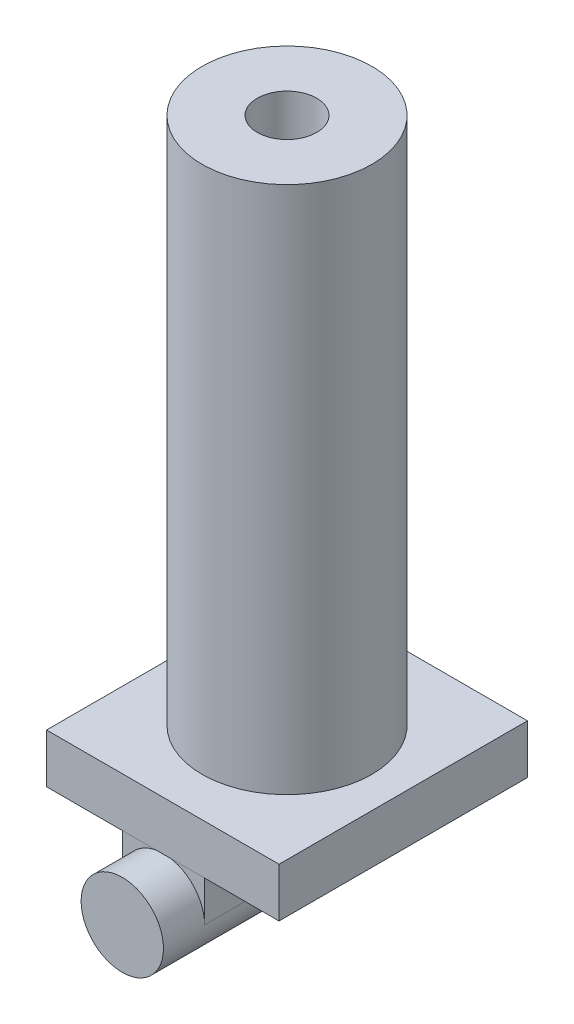
ISO-10303-21;
HEADER;
FILE_DESCRIPTION(('STEP AP214'),'2;1');
FILE_NAME('part.step','',(''),(''),'','','');
FILE_SCHEMA(('AUTOMOTIVE_DESIGN { 1 0 10303 214 1 1 1 1 }'));
ENDSEC;
DATA;
#1=APPLICATION_CONTEXT('core data for automotive mechanical design processes');
#2=APPLICATION_PROTOCOL_DEFINITION('international standard','automotive_design',2000,#1);
#3=PRODUCT_CONTEXT('',#1,'mechanical');
#4=PRODUCT('Part','Part','',(#3));
#5=PRODUCT_RELATED_PRODUCT_CATEGORY('part','',(#4));
#6=PRODUCT_DEFINITION_FORMATION('','',#4);
#7=PRODUCT_DEFINITION_CONTEXT('part definition',#1,'design');
#8=PRODUCT_DEFINITION('design','',#6,#7);
#9=PRODUCT_DEFINITION_SHAPE('','',#8);
#10=(LENGTH_UNIT() NAMED_UNIT(*) SI_UNIT(.MILLI.,.METRE.));
#11=(NAMED_UNIT(*) PLANE_ANGLE_UNIT() SI_UNIT($,.RADIAN.));
#12=(NAMED_UNIT(*) SI_UNIT($,.STERADIAN.) SOLID_ANGLE_UNIT());
#13=UNCERTAINTY_MEASURE_WITH_UNIT(LENGTH_MEASURE(1.E-05),#10,'distance_accuracy_value','');
#14=(GEOMETRIC_REPRESENTATION_CONTEXT(3) GLOBAL_UNCERTAINTY_ASSIGNED_CONTEXT((#13)) GLOBAL_UNIT_ASSIGNED_CONTEXT((#10,
#11,#12)) REPRESENTATION_CONTEXT('',''));
#15=CARTESIAN_POINT('',(0.,0.,0.));
#16=DIRECTION('',(0.,0.,1.));
#17=DIRECTION('',(1.,0.,0.));
#18=AXIS2_PLACEMENT_3D('',#15,#16,#17);
#19=CARTESIAN_POINT('',(0.,-76.818114505871,101.6));
#20=DIRECTION('',(0.,0.,-1.));
#21=DIRECTION('',(0.707106781186548,0.707106781186548,0.));
#22=AXIS2_PLACEMENT_3D('',#19,#20,#21);
#23=PLANE('',#22);
#24=CARTESIAN_POINT('',(0.,-76.818114505871,101.6));
#25=DIRECTION('',(0.,0.,-1.));
#26=DIRECTION('',(-1.,0.,0.));
#27=AXIS2_PLACEMENT_3D('',#24,#25,#26);
#28=CIRCLE('',#27,25.4);
#29=CARTESIAN_POINT('',(25.4,-76.818114505871,101.6));
#30=VERTEX_POINT('',#29);
#31=EDGE_CURVE('E34',#30,#30,#28,.T.);
#32=ORIENTED_EDGE('',*,*,#31,.F.);
#33=EDGE_LOOP('',(#32));
#34=FACE_BOUND('',#33,.T.);
#35=ADVANCED_FACE('F17',(#34),#23,.F.);
#36=CARTESIAN_POINT('',(52.463748097312,-51.4181145058709,0.));
#37=DIRECTION('',(0.,-1.,0.));
#38=DIRECTION('',(0.707106781186548,0.,0.707106781186548));
#39=AXIS2_PLACEMENT_3D('',#36,#37,#38);
#40=PLANE('',#39);
#41=DIRECTION('',(0.,0.,1.));
#42=VECTOR('',#41,1.);
#43=CARTESIAN_POINT('',(0.,-51.4181145058709,76.2));
#44=LINE('',#43,#42);
#45=CARTESIAN_POINT('',(0.,-51.4181145058709,76.2));
#46=VERTEX_POINT('',#45);
#47=CARTESIAN_POINT('',(0.,-51.4181145058709,76.6143488214767));
#48=VERTEX_POINT('',#47);
#49=EDGE_CURVE('E121',#46,#48,#44,.T.);
#50=ORIENTED_EDGE('',*,*,#49,.F.);
#51=DIRECTION('',(1.,0.,0.));
#52=VECTOR('',#51,1.);
#53=CARTESIAN_POINT('',(26.231874048656,-51.4181145058709,76.2));
#54=LINE('',#53,#52);
#55=CARTESIAN_POINT('',(25.4,-51.4181145058709,76.2));
#56=VERTEX_POINT('',#55);
#57=EDGE_CURVE('E11',#46,#56,#54,.T.);
#58=ORIENTED_EDGE('',*,*,#57,.T.);
#59=DIRECTION('',(0.,0.,-1.));
#60=VECTOR('',#59,1.);
#61=CARTESIAN_POINT('',(25.4,-51.4181145058709,0.));
#62=LINE('',#61,#60);
#63=CARTESIAN_POINT('',(25.4,-51.4181145058709,-76.2));
#64=VERTEX_POINT('',#63);
#65=EDGE_CURVE('E27',#56,#64,#62,.T.);
#66=ORIENTED_EDGE('',*,*,#65,.T.);
#67=DIRECTION('',(-1.,0.,0.));
#68=VECTOR('',#67,1.);
#69=CARTESIAN_POINT('',(26.231874048656,-51.4181145058709,-76.2));
#70=LINE('',#69,#68);
#71=CARTESIAN_POINT('',(0.,-51.4181145058709,-76.2));
#72=VERTEX_POINT('',#71);
#73=EDGE_CURVE('E136',#64,#72,#70,.T.);
#74=ORIENTED_EDGE('',*,*,#73,.T.);
#75=DIRECTION('',(0.,0.,-1.));
#76=VECTOR('',#75,1.);
#77=CARTESIAN_POINT('',(0.,-51.4181145058709,-76.2));
#78=LINE('',#77,#76);
#79=CARTESIAN_POINT('',(0.,-51.4181145058709,-76.6143488214766));
#80=VERTEX_POINT('',#79);
#81=EDGE_CURVE('E139',#72,#80,#78,.T.);
#82=ORIENTED_EDGE('',*,*,#81,.T.);
#83=DIRECTION('',(1.,0.,0.));
#84=VECTOR('',#83,1.);
#85=CARTESIAN_POINT('',(62.0788439775563,-51.4181145058709,-76.6143488214766));
#86=LINE('',#85,#84);
#87=CARTESIAN_POINT('',(71.6939398578006,-51.4181145058709,-76.6143488214767));
#88=VERTEX_POINT('',#87);
#89=EDGE_CURVE('E142',#80,#88,#86,.T.);
#90=ORIENTED_EDGE('',*,*,#89,.T.);
#91=DIRECTION('',(0.,0.,1.));
#92=VECTOR('',#91,1.);
#93=CARTESIAN_POINT('',(71.6939398578006,-51.4181145058709,38.3071744107383));
#94=LINE('',#93,#92);
#95=CARTESIAN_POINT('',(71.6939398578006,-51.4181145058709,76.6143488214766));
#96=VERTEX_POINT('',#95);
#97=EDGE_CURVE('E145',#88,#96,#94,.T.);
#98=ORIENTED_EDGE('',*,*,#97,.T.);
#99=DIRECTION('',(-1.,0.,0.));
#100=VECTOR('',#99,1.);
#101=CARTESIAN_POINT('',(-9.61509588024429,-51.4181145058709,76.6143488214767));
#102=LINE('',#101,#100);
#103=EDGE_CURVE('E148',#96,#48,#102,.T.);
#104=ORIENTED_EDGE('',*,*,#103,.T.);
#105=EDGE_LOOP('',(#50,#58,#66,#74,#82,#90,#98,#104));
#106=FACE_BOUND('',#105,.T.);
#107=ADVANCED_FACE('F234',(#106),#40,.T.);
#108=CARTESIAN_POINT('',(0.,-72.5615516087403,76.2));
#109=DIRECTION('',(0.,0.,1.));
#110=DIRECTION('',(0.707106781186548,0.707106781186548,0.));
#111=AXIS2_PLACEMENT_3D('',#108,#109,#110);
#112=PLANE('',#111);
#113=CARTESIAN_POINT('',(0.,-76.818114505871,76.2));
#114=DIRECTION('',(0.,0.,-1.));
#115=DIRECTION('',(-1.,0.,0.));
#116=AXIS2_PLACEMENT_3D('',#113,#114,#115);
#117=CIRCLE('',#116,25.4);
#118=CARTESIAN_POINT('',(25.4,-76.8181145058709,76.2));
#119=VERTEX_POINT('',#118);
#120=EDGE_CURVE('E150',#46,#119,#117,.T.);
#121=ORIENTED_EDGE('',*,*,#120,.T.);
#122=DIRECTION('',(0.,-1.,0.));
#123=VECTOR('',#122,1.);
#124=CARTESIAN_POINT('',(25.4,-76.8181145058709,76.2));
#125=LINE('',#124,#123);
#126=EDGE_CURVE('E154',#56,#119,#125,.T.);
#127=ORIENTED_EDGE('',*,*,#126,.F.);
#128=ORIENTED_EDGE('',*,*,#57,.F.);
#129=EDGE_LOOP('',(#121,#127,#128));
#130=FACE_BOUND('',#129,.T.);
#131=ADVANCED_FACE('F239',(#130),#112,.T.);
#132=CARTESIAN_POINT('',(0.,-76.818114505871,-101.6));
#133=DIRECTION('',(0.,0.,1.));
#134=DIRECTION('',(0.707106781186548,0.707106781186548,0.));
#135=AXIS2_PLACEMENT_3D('',#132,#133,#134);
#136=PLANE('',#135);
#137=CARTESIAN_POINT('',(0.,-76.818114505871,-101.6));
#138=DIRECTION('',(0.,0.,1.));
#139=DIRECTION('',(1.,0.,0.));
#140=AXIS2_PLACEMENT_3D('',#137,#138,#139);
#141=CIRCLE('',#140,25.4);
#142=CARTESIAN_POINT('',(-25.4,-76.818114505871,-101.6));
#143=VERTEX_POINT('',#142);
#144=EDGE_CURVE('E158',#143,#143,#141,.T.);
#145=ORIENTED_EDGE('',*,*,#144,.F.);
#146=EDGE_LOOP('',(#145));
#147=FACE_BOUND('',#146,.T.);
#148=ADVANCED_FACE('F245',(#147),#136,.F.);
#149=CARTESIAN_POINT('',(0.,-72.5615516087403,-76.2));
#150=DIRECTION('',(0.,0.,1.));
#151=DIRECTION('',(0.707106781186548,0.707106781186548,0.));
#152=AXIS2_PLACEMENT_3D('',#149,#150,#151);
#153=PLANE('',#152);
#154=CARTESIAN_POINT('',(0.,-76.818114505871,-76.2));
#155=DIRECTION('',(0.,0.,1.));
#156=DIRECTION('',(1.,0.,0.));
#157=AXIS2_PLACEMENT_3D('',#154,#155,#156);
#158=CIRCLE('',#157,25.4);
#159=CARTESIAN_POINT('',(-25.4,-76.818114505871,-76.2));
#160=VERTEX_POINT('',#159);
#161=EDGE_CURVE('E153',#72,#160,#158,.T.);
#162=ORIENTED_EDGE('',*,*,#161,.T.);
#163=DIRECTION('',(0.,-1.,0.));
#164=VECTOR('',#163,1.);
#165=CARTESIAN_POINT('',(-25.4,-51.4181145058709,-76.2));
#166=LINE('',#165,#164);
#167=CARTESIAN_POINT('',(-25.4,-51.4181145058709,-76.2));
#168=VERTEX_POINT('',#167);
#169=EDGE_CURVE('E164',#168,#160,#166,.T.);
#170=ORIENTED_EDGE('',*,*,#169,.F.);
#171=DIRECTION('',(-1.,0.,0.));
#172=VECTOR('',#171,1.);
#173=CARTESIAN_POINT('',(26.231874048656,-51.4181145058709,-76.2));
#174=LINE('',#173,#172);
#175=EDGE_CURVE('E168',#72,#168,#174,.T.);
#176=ORIENTED_EDGE('',*,*,#175,.F.);
#177=EDGE_LOOP('',(#162,#170,#176));
#178=FACE_BOUND('',#177,.T.);
#179=ADVANCED_FACE('F249',(#178),#153,.F.);
#180=CARTESIAN_POINT('',(0.,-72.5615516087403,-76.2));
#181=DIRECTION('',(0.,0.,1.));
#182=DIRECTION('',(0.707106781186548,0.707106781186548,0.));
#183=AXIS2_PLACEMENT_3D('',#180,#181,#182);
#184=PLANE('',#183);
#185=CARTESIAN_POINT('',(0.,-76.818114505871,-76.2));
#186=DIRECTION('',(0.,0.,1.));
#187=DIRECTION('',(1.,0.,0.));
#188=AXIS2_PLACEMENT_3D('',#185,#186,#187);
#189=CIRCLE('',#188,25.4);
#190=CARTESIAN_POINT('',(25.4,-76.8181145058709,-76.2));
#191=VERTEX_POINT('',#190);
#192=EDGE_CURVE('E156',#191,#72,#189,.T.);
#193=ORIENTED_EDGE('',*,*,#192,.T.);
#194=ORIENTED_EDGE('',*,*,#73,.F.);
#195=DIRECTION('',(0.,1.,0.));
#196=VECTOR('',#195,1.);
#197=CARTESIAN_POINT('',(25.4,-76.8181145058709,-76.2));
#198=LINE('',#197,#196);
#199=EDGE_CURVE('E157',#191,#64,#198,.T.);
#200=ORIENTED_EDGE('',*,*,#199,.F.);
#201=EDGE_LOOP('',(#193,#194,#200));
#202=FACE_BOUND('',#201,.T.);
#203=ADVANCED_FACE('F253',(#202),#184,.F.);
#204=CARTESIAN_POINT('',(25.4,-51.4181145058709,0.));
#205=DIRECTION('',(1.,0.,0.));
#206=DIRECTION('',(0.,0.707106781186548,0.707106781186548));
#207=AXIS2_PLACEMENT_3D('',#204,#205,#206);
#208=PLANE('',#207);
#209=ORIENTED_EDGE('',*,*,#126,.T.);
#210=DIRECTION('',(0.,0.,1.));
#211=VECTOR('',#210,1.);
#212=CARTESIAN_POINT('',(25.4,-76.8181145058709,0.));
#213=LINE('',#212,#211);
#214=EDGE_CURVE('E176',#191,#119,#213,.T.);
#215=ORIENTED_EDGE('',*,*,#214,.F.);
#216=ORIENTED_EDGE('',*,*,#199,.T.);
#217=ORIENTED_EDGE('',*,*,#65,.F.);
#218=EDGE_LOOP('',(#209,#215,#216,#217));
#219=FACE_BOUND('',#218,.T.);
#220=ADVANCED_FACE('F257',(#219),#208,.T.);
#221=CARTESIAN_POINT('',(0.,-76.818114505871,0.));
#222=DIRECTION('',(0.,0.,1.));
#223=DIRECTION('',(-1.,0.,0.));
#224=AXIS2_PLACEMENT_3D('',#221,#222,#223);
#225=CYLINDRICAL_SURFACE('',#224,25.4);
#226=ORIENTED_EDGE('',*,*,#31,.T.);
#227=EDGE_LOOP('',(#226));
#228=FACE_BOUND('',#227,.T.);
#229=ORIENTED_EDGE('',*,*,#144,.T.);
#230=EDGE_LOOP('',(#229));
#231=FACE_BOUND('',#230,.T.);
#232=DIRECTION('',(0.,0.,1.));
#233=VECTOR('',#232,1.);
#234=CARTESIAN_POINT('',(-25.4,-76.818114505871,0.));
#235=LINE('',#234,#233);
#236=CARTESIAN_POINT('',(-25.4,-76.818114505871,76.2));
#237=VERTEX_POINT('',#236);
#238=EDGE_CURVE('E167',#160,#237,#235,.T.);
#239=ORIENTED_EDGE('',*,*,#238,.F.);
#240=ORIENTED_EDGE('',*,*,#161,.F.);
#241=DIRECTION('',(0.,0.,-1.));
#242=VECTOR('',#241,1.);
#243=CARTESIAN_POINT('',(0.,-51.4181145058709,-76.2));
#244=LINE('',#243,#242);
#245=CARTESIAN_POINT('',(0.,-51.4181145058709,-76.6143488214766));
#246=VERTEX_POINT('',#245);
#247=EDGE_CURVE('E161',#72,#246,#244,.T.);
#248=ORIENTED_EDGE('',*,*,#247,.T.);
#249=ORIENTED_EDGE('',*,*,#247,.F.);
#250=ORIENTED_EDGE('',*,*,#192,.F.);
#251=ORIENTED_EDGE('',*,*,#214,.T.);
#252=ORIENTED_EDGE('',*,*,#120,.F.);
#253=DIRECTION('',(0.,0.,1.));
#254=VECTOR('',#253,1.);
#255=CARTESIAN_POINT('',(0.,-51.4181145058709,76.2));
#256=LINE('',#255,#254);
#257=CARTESIAN_POINT('',(0.,-51.4181145058709,76.6143488214767));
#258=VERTEX_POINT('',#257);
#259=EDGE_CURVE('E179',#46,#258,#256,.T.);
#260=ORIENTED_EDGE('',*,*,#259,.T.);
#261=ORIENTED_EDGE('',*,*,#259,.F.);
#262=CARTESIAN_POINT('',(0.,-76.818114505871,76.2));
#263=DIRECTION('',(0.,0.,-1.));
#264=DIRECTION('',(-1.,0.,0.));
#265=AXIS2_PLACEMENT_3D('',#262,#263,#264);
#266=CIRCLE('',#265,25.4);
#267=EDGE_CURVE('E182',#237,#46,#266,.T.);
#268=ORIENTED_EDGE('',*,*,#267,.F.);
#269=EDGE_LOOP('',(#239,#240,#248,#249,#250,#251,#252,#260,#261,#268));
#270=FACE_BOUND('',#269,.T.);
#271=ADVANCED_FACE('F261',(#228,#231,#270),#225,.T.);
#272=CARTESIAN_POINT('',(-25.4,-76.818114505871,0.));
#273=DIRECTION('',(-1.,0.,0.));
#274=DIRECTION('',(0.,0.707106781186548,0.707106781186548));
#275=AXIS2_PLACEMENT_3D('',#272,#273,#274);
#276=PLANE('',#275);
#277=DIRECTION('',(0.,1.,0.));
#278=VECTOR('',#277,1.);
#279=CARTESIAN_POINT('',(-25.4,-51.4181145058709,76.2));
#280=LINE('',#279,#278);
#281=CARTESIAN_POINT('',(-25.4,-51.4181145058709,76.2));
#282=VERTEX_POINT('',#281);
#283=EDGE_CURVE('E166',#237,#282,#280,.T.);
#284=ORIENTED_EDGE('',*,*,#283,.T.);
#285=DIRECTION('',(0.,0.,1.));
#286=VECTOR('',#285,1.);
#287=CARTESIAN_POINT('',(-25.4,-51.4181145058709,0.));
#288=LINE('',#287,#286);
#289=EDGE_CURVE('E171',#168,#282,#288,.T.);
#290=ORIENTED_EDGE('',*,*,#289,.F.);
#291=ORIENTED_EDGE('',*,*,#169,.T.);
#292=ORIENTED_EDGE('',*,*,#238,.T.);
#293=EDGE_LOOP('',(#284,#290,#291,#292));
#294=FACE_BOUND('',#293,.T.);
#295=ADVANCED_FACE('F265',(#294),#276,.T.);
#296=CARTESIAN_POINT('',(0.,-72.5615516087403,76.2));
#297=DIRECTION('',(0.,0.,1.));
#298=DIRECTION('',(0.707106781186548,0.707106781186548,0.));
#299=AXIS2_PLACEMENT_3D('',#296,#297,#298);
#300=PLANE('',#299);
#301=ORIENTED_EDGE('',*,*,#267,.T.);
#302=DIRECTION('',(1.,0.,0.));
#303=VECTOR('',#302,1.);
#304=CARTESIAN_POINT('',(26.231874048656,-51.4181145058709,76.2));
#305=LINE('',#304,#303);
#306=EDGE_CURVE('E191',#282,#46,#305,.T.);
#307=ORIENTED_EDGE('',*,*,#306,.F.);
#308=ORIENTED_EDGE('',*,*,#283,.F.);
#309=EDGE_LOOP('',(#301,#307,#308));
#310=FACE_BOUND('',#309,.T.);
#311=ADVANCED_FACE('F269',(#310),#300,.T.);
#312=CARTESIAN_POINT('',(71.6939398578006,-21.0708687699479,76.6143488214766));
#313=DIRECTION('',(1.,0.,0.));
#314=DIRECTION('',(0.,0.707106781186548,0.707106781186548));
#315=AXIS2_PLACEMENT_3D('',#312,#313,#314);
#316=PLANE('',#315);
#317=ORIENTED_EDGE('',*,*,#97,.F.);
#318=DIRECTION('',(0.,-1.,0.));
#319=VECTOR('',#318,1.);
#320=CARTESIAN_POINT('',(71.6939398578006,-36.2444916379094,-76.6143488214767));
#321=LINE('',#320,#319);
#322=CARTESIAN_POINT('',(71.6939398578006,-21.0708687699479,-76.6143488214766));
#323=VERTEX_POINT('',#322);
#324=EDGE_CURVE('E193',#323,#88,#321,.T.);
#325=ORIENTED_EDGE('',*,*,#324,.F.);
#326=DIRECTION('',(0.,0.,-1.));
#327=VECTOR('',#326,1.);
#328=CARTESIAN_POINT('',(71.6939398578006,-21.0708687699479,38.3071744107383));
#329=LINE('',#328,#327);
#330=CARTESIAN_POINT('',(71.6939398578006,-21.0708687699479,76.6143488214766));
#331=VERTEX_POINT('',#330);
#332=EDGE_CURVE('E197',#331,#323,#329,.T.);
#333=ORIENTED_EDGE('',*,*,#332,.F.);
#334=DIRECTION('',(0.,-1.,0.));
#335=VECTOR('',#334,1.);
#336=CARTESIAN_POINT('',(71.6939398578006,-36.2444916379094,76.6143488214766));
#337=LINE('',#336,#335);
#338=EDGE_CURVE('E187',#331,#96,#337,.T.);
#339=ORIENTED_EDGE('',*,*,#338,.T.);
#340=EDGE_LOOP('',(#317,#325,#333,#339));
#341=FACE_BOUND('',#340,.T.);
#342=ADVANCED_FACE('F273',(#341),#316,.T.);
#343=CARTESIAN_POINT('',(-71.6939398578006,-21.0708687699479,76.6143488214767));
#344=DIRECTION('',(0.,0.,1.));
#345=DIRECTION('',(0.707106781186548,0.707106781186548,0.));
#346=AXIS2_PLACEMENT_3D('',#343,#344,#345);
#347=PLANE('',#346);
#348=ORIENTED_EDGE('',*,*,#103,.F.);
#349=ORIENTED_EDGE('',*,*,#338,.F.);
#350=DIRECTION('',(1.,0.,0.));
#351=VECTOR('',#350,1.);
#352=CARTESIAN_POINT('',(3.47864037839609,-21.0708687699479,76.6143488214767));
#353=LINE('',#352,#351);
#354=CARTESIAN_POINT('',(-71.6939398578006,-21.0708687699479,76.6143488214767));
#355=VERTEX_POINT('',#354);
#356=EDGE_CURVE('E199',#355,#331,#353,.T.);
#357=ORIENTED_EDGE('',*,*,#356,.F.);
#358=DIRECTION('',(0.,1.,0.));
#359=VECTOR('',#358,1.);
#360=CARTESIAN_POINT('',(-71.6939398578006,-36.2444916379094,76.6143488214767));
#361=LINE('',#360,#359);
#362=CARTESIAN_POINT('',(-71.6939398578006,-51.4181145058709,76.6143488214767));
#363=VERTEX_POINT('',#362);
#364=EDGE_CURVE('E196',#363,#355,#361,.T.);
#365=ORIENTED_EDGE('',*,*,#364,.F.);
#366=DIRECTION('',(-1.,0.,0.));
#367=VECTOR('',#366,1.);
#368=CARTESIAN_POINT('',(-9.61509588024429,-51.4181145058709,76.6143488214767));
#369=LINE('',#368,#367);
#370=EDGE_CURVE('E125',#48,#363,#369,.T.);
#371=ORIENTED_EDGE('',*,*,#370,.F.);
#372=EDGE_LOOP('',(#348,#349,#357,#365,#371));
#373=FACE_BOUND('',#372,.T.);
#374=ADVANCED_FACE('F277',(#373),#347,.T.);
#375=CARTESIAN_POINT('',(71.6939398578006,-21.0708687699479,-76.6143488214766));
#376=DIRECTION('',(0.,0.,-1.));
#377=DIRECTION('',(0.707106781186548,0.707106781186548,0.));
#378=AXIS2_PLACEMENT_3D('',#375,#376,#377);
#379=PLANE('',#378);
#380=DIRECTION('',(1.,0.,0.));
#381=VECTOR('',#380,1.);
#382=CARTESIAN_POINT('',(62.0788439775563,-51.4181145058709,-76.6143488214766));
#383=LINE('',#382,#381);
#384=CARTESIAN_POINT('',(-71.6939398578006,-51.4181145058709,-76.6143488214766));
#385=VERTEX_POINT('',#384);
#386=EDGE_CURVE('E170',#385,#80,#383,.T.);
#387=ORIENTED_EDGE('',*,*,#386,.F.);
#388=DIRECTION('',(0.,-1.,0.));
#389=VECTOR('',#388,1.);
#390=CARTESIAN_POINT('',(-71.6939398578006,-36.2444916379094,-76.6143488214766));
#391=LINE('',#390,#389);
#392=CARTESIAN_POINT('',(-71.6939398578006,-21.0708687699479,-76.6143488214766));
#393=VERTEX_POINT('',#392);
#394=EDGE_CURVE('E205',#393,#385,#391,.T.);
#395=ORIENTED_EDGE('',*,*,#394,.F.);
#396=DIRECTION('',(-1.,0.,0.));
#397=VECTOR('',#396,1.);
#398=CARTESIAN_POINT('',(75.1725802361967,-21.0708687699479,-76.6143488214766));
#399=LINE('',#398,#397);
#400=EDGE_CURVE('E123',#323,#393,#399,.T.);
#401=ORIENTED_EDGE('',*,*,#400,.F.);
#402=ORIENTED_EDGE('',*,*,#324,.T.);
#403=ORIENTED_EDGE('',*,*,#89,.F.);
#404=EDGE_LOOP('',(#387,#395,#401,#402,#403));
#405=FACE_BOUND('',#404,.T.);
#406=ADVANCED_FACE('F281',(#405),#379,.T.);
#407=CARTESIAN_POINT('',(-71.6939398578006,-21.0708687699479,-76.6143488214766));
#408=DIRECTION('',(-1.,0.,0.));
#409=DIRECTION('',(0.,0.707106781186548,0.707106781186548));
#410=AXIS2_PLACEMENT_3D('',#407,#408,#409);
#411=PLANE('',#410);
#412=DIRECTION('',(0.,0.,-1.));
#413=VECTOR('',#412,1.);
#414=CARTESIAN_POINT('',(-71.6939398578006,-51.4181145058709,-38.3071744107383));
#415=LINE('',#414,#413);
#416=EDGE_CURVE('E130',#363,#385,#415,.T.);
#417=ORIENTED_EDGE('',*,*,#416,.F.);
#418=ORIENTED_EDGE('',*,*,#364,.T.);
#419=DIRECTION('',(0.,0.,1.));
#420=VECTOR('',#419,1.);
#421=CARTESIAN_POINT('',(-71.6939398578006,-21.0708687699479,-38.3071744107383));
#422=LINE('',#421,#420);
#423=EDGE_CURVE('E120',#393,#355,#422,.T.);
#424=ORIENTED_EDGE('',*,*,#423,.F.);
#425=ORIENTED_EDGE('',*,*,#394,.T.);
#426=EDGE_LOOP('',(#417,#418,#424,#425));
#427=FACE_BOUND('',#426,.T.);
#428=ADVANCED_FACE('F285',(#427),#411,.T.);
#429=CARTESIAN_POINT('',(0.,152.4,0.));
#430=DIRECTION('',(0.,1.,0.));
#431=DIRECTION('',(1.,0.,0.));
#432=AXIS2_PLACEMENT_3D('',#429,#430,#431);
#433=CYLINDRICAL_SURFACE('',#432,18.3268132970563);
#434=CARTESIAN_POINT('',(0.,304.8,0.));
#435=DIRECTION('',(0.,-1.,0.));
#436=DIRECTION('',(1.,0.,0.));
#437=AXIS2_PLACEMENT_3D('',#434,#435,#436);
#438=CIRCLE('',#437,18.3268132970563);
#439=CARTESIAN_POINT('',(18.3268132970563,304.8,0.));
#440=VERTEX_POINT('',#439);
#441=EDGE_CURVE('E215',#440,#440,#438,.T.);
#442=ORIENTED_EDGE('',*,*,#441,.F.);
#443=EDGE_LOOP('',(#442));
#444=FACE_BOUND('',#443,.T.);
#445=CARTESIAN_POINT('',(0.,0.,0.));
#446=DIRECTION('',(0.,-1.,0.));
#447=DIRECTION('',(1.,0.,0.));
#448=AXIS2_PLACEMENT_3D('',#445,#446,#447);
#449=CIRCLE('',#448,18.3268132970563);
#450=CARTESIAN_POINT('',(18.3268132970563,0.,0.));
#451=VERTEX_POINT('',#450);
#452=EDGE_CURVE('E211',#451,#451,#449,.T.);
#453=ORIENTED_EDGE('',*,*,#452,.T.);
#454=EDGE_LOOP('',(#453));
#455=FACE_BOUND('',#454,.T.);
#456=ADVANCED_FACE('F231',(#444,#455),#433,.F.);
#457=CARTESIAN_POINT('',(35.3508791658089,304.8,0.));
#458=DIRECTION('',(0.,1.,0.));
#459=DIRECTION('',(0.707106781186548,0.,0.707106781186548));
#460=AXIS2_PLACEMENT_3D('',#457,#458,#459);
#461=PLANE('',#460);
#462=CARTESIAN_POINT('',(0.,304.8,0.));
#463=DIRECTION('',(0.,-1.,0.));
#464=DIRECTION('',(1.,0.,0.));
#465=AXIS2_PLACEMENT_3D('',#462,#463,#464);
#466=CIRCLE('',#465,52.3749450345615);
#467=CARTESIAN_POINT('',(52.3749450345615,304.8,0.));
#468=VERTEX_POINT('',#467);
#469=EDGE_CURVE('E113',#468,#468,#466,.T.);
#470=ORIENTED_EDGE('',*,*,#469,.F.);
#471=EDGE_LOOP('',(#470));
#472=FACE_BOUND('',#471,.T.);
#473=ORIENTED_EDGE('',*,*,#441,.T.);
#474=EDGE_LOOP('',(#473));
#475=FACE_BOUND('',#474,.T.);
#476=ADVANCED_FACE('F221',(#472,#475),#461,.T.);
#477=CARTESIAN_POINT('',(0.,141.864565615026,0.));
#478=DIRECTION('',(0.,-1.,0.));
#479=DIRECTION('',(1.,0.,0.));
#480=AXIS2_PLACEMENT_3D('',#477,#478,#479);
#481=CYLINDRICAL_SURFACE('',#480,52.3749450345615);
#482=CARTESIAN_POINT('',(0.,-21.0708687699479,0.));
#483=DIRECTION('',(0.,-1.,0.));
#484=DIRECTION('',(1.,0.,0.));
#485=AXIS2_PLACEMENT_3D('',#482,#483,#484);
#486=CIRCLE('',#485,52.3749450345615);
#487=CARTESIAN_POINT('',(52.3749450345615,-21.0708687699479,0.));
#488=VERTEX_POINT('',#487);
#489=EDGE_CURVE('E21',#488,#488,#486,.T.);
#490=ORIENTED_EDGE('',*,*,#489,.F.);
#491=EDGE_LOOP('',(#490));
#492=FACE_BOUND('',#491,.T.);
#493=ORIENTED_EDGE('',*,*,#469,.T.);
#494=EDGE_LOOP('',(#493));
#495=FACE_BOUND('',#494,.T.);
#496=ADVANCED_FACE('F117',(#492,#495),#481,.T.);
#497=CARTESIAN_POINT('',(78.6512206145928,-21.0708687699479,0.));
#498=DIRECTION('',(0.,1.,0.));
#499=DIRECTION('',(0.707106781186548,0.,0.707106781186548));
#500=AXIS2_PLACEMENT_3D('',#497,#498,#499);
#501=PLANE('',#500);
#502=ORIENTED_EDGE('',*,*,#356,.T.);
#503=ORIENTED_EDGE('',*,*,#332,.T.);
#504=ORIENTED_EDGE('',*,*,#400,.T.);
#505=ORIENTED_EDGE('',*,*,#423,.T.);
#506=EDGE_LOOP('',(#502,#503,#504,#505));
#507=FACE_BOUND('',#506,.T.);
#508=ORIENTED_EDGE('',*,*,#489,.T.);
#509=EDGE_LOOP('',(#508));
#510=FACE_BOUND('',#509,.T.);
#511=ADVANCED_FACE('F220',(#507,#510),#501,.T.);
#512=CARTESIAN_POINT('',(52.463748097312,-51.4181145058709,0.));
#513=DIRECTION('',(0.,-1.,0.));
#514=DIRECTION('',(0.707106781186548,0.,0.707106781186548));
#515=AXIS2_PLACEMENT_3D('',#512,#513,#514);
#516=PLANE('',#515);
#517=ORIENTED_EDGE('',*,*,#49,.T.);
#518=ORIENTED_EDGE('',*,*,#370,.T.);
#519=ORIENTED_EDGE('',*,*,#416,.T.);
#520=ORIENTED_EDGE('',*,*,#386,.T.);
#521=ORIENTED_EDGE('',*,*,#81,.F.);
#522=ORIENTED_EDGE('',*,*,#175,.T.);
#523=ORIENTED_EDGE('',*,*,#289,.T.);
#524=ORIENTED_EDGE('',*,*,#306,.T.);
#525=EDGE_LOOP('',(#517,#518,#519,#520,#521,#522,#523,#524));
#526=FACE_BOUND('',#525,.T.);
#527=ADVANCED_FACE('F228',(#526),#516,.T.);
#528=CARTESIAN_POINT('',(9.16340664852814,0.,0.));
#529=DIRECTION('',(0.,1.,0.));
#530=DIRECTION('',(0.707106781186548,0.,0.707106781186548));
#531=AXIS2_PLACEMENT_3D('',#528,#529,#530);
#532=PLANE('',#531);
#533=ORIENTED_EDGE('',*,*,#452,.F.);
#534=EDGE_LOOP('',(#533));
#535=FACE_BOUND('',#534,.T.);
#536=ADVANCED_FACE('F19',(#535),#532,.T.);
#537=CLOSED_SHELL('',(#35,#107,#131,#148,#179,#203,#220,#271,#295,#311,#342,#374,#406,#428,#456,
#476,#496,#511,#527,#536));
#538=MANIFOLD_SOLID_BREP('B1',#537);
#539=ADVANCED_BREP_SHAPE_REPRESENTATION('',(#18,#538),#14);
#540=SHAPE_DEFINITION_REPRESENTATION(#9,#539);
ENDSEC;
END-ISO-10303-21;
